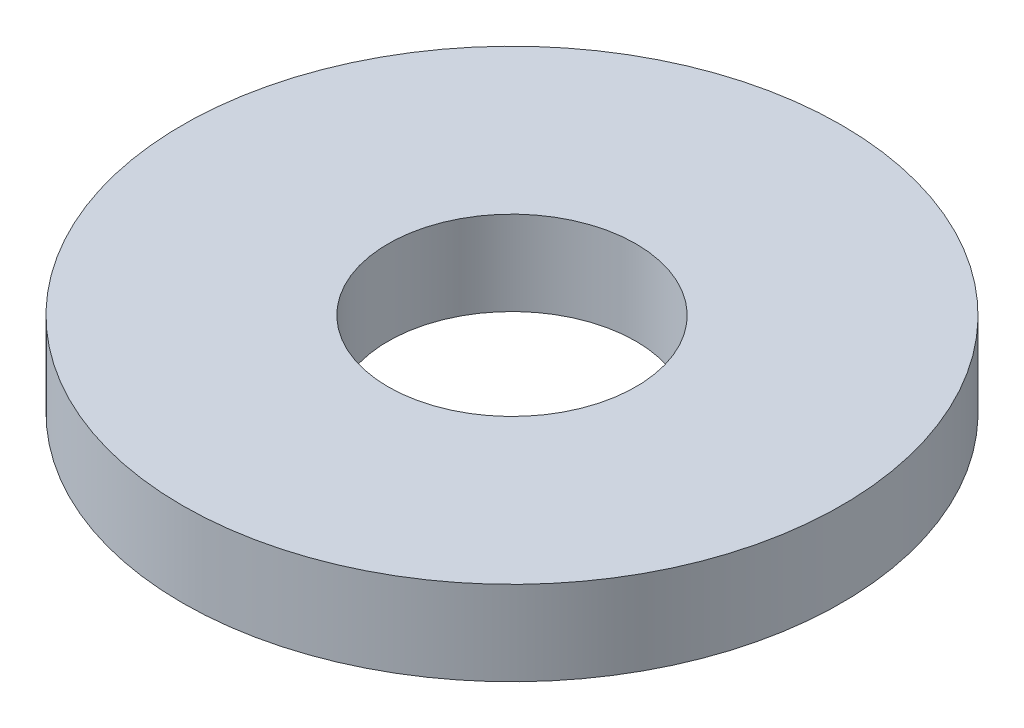
ISO-10303-21;
HEADER;
FILE_DESCRIPTION(('STEP AP214'),'2;1');
FILE_NAME('part.step','',(''),(''),'','','');
FILE_SCHEMA(('AUTOMOTIVE_DESIGN { 1 0 10303 214 1 1 1 1 }'));
ENDSEC;
DATA;
#1=APPLICATION_CONTEXT('core data for automotive mechanical design processes');
#2=APPLICATION_PROTOCOL_DEFINITION('international standard','automotive_design',2000,#1);
#3=PRODUCT_CONTEXT('',#1,'mechanical');
#4=PRODUCT('Part','Part','',(#3));
#5=PRODUCT_RELATED_PRODUCT_CATEGORY('part','',(#4));
#6=PRODUCT_DEFINITION_FORMATION('','',#4);
#7=PRODUCT_DEFINITION_CONTEXT('part definition',#1,'design');
#8=PRODUCT_DEFINITION('design','',#6,#7);
#9=PRODUCT_DEFINITION_SHAPE('','',#8);
#10=(LENGTH_UNIT() NAMED_UNIT(*) SI_UNIT(.MILLI.,.METRE.));
#11=(NAMED_UNIT(*) PLANE_ANGLE_UNIT() SI_UNIT($,.RADIAN.));
#12=(NAMED_UNIT(*) SI_UNIT($,.STERADIAN.) SOLID_ANGLE_UNIT());
#13=UNCERTAINTY_MEASURE_WITH_UNIT(LENGTH_MEASURE(1.E-05),#10,'distance_accuracy_value','');
#14=(GEOMETRIC_REPRESENTATION_CONTEXT(3) GLOBAL_UNCERTAINTY_ASSIGNED_CONTEXT((#13)) GLOBAL_UNIT_ASSIGNED_CONTEXT((#10,
#11,#12)) REPRESENTATION_CONTEXT('',''));
#15=CARTESIAN_POINT('',(0.,0.,0.));
#16=DIRECTION('',(0.,0.,1.));
#17=DIRECTION('',(1.,0.,0.));
#18=AXIS2_PLACEMENT_3D('',#15,#16,#17);
#19=CARTESIAN_POINT('',(3.5527136788005E-12,0.812799999993397,9.76996261670138E-12));
#20=DIRECTION('',(0.,-1.00000000000003,0.));
#21=DIRECTION('',(0.,0.,-1.00000000000019));
#22=AXIS2_PLACEMENT_3D('',#19,#20,#21);
#23=CYLINDRICAL_SURFACE('',#22,3.175);
#24=CARTESIAN_POINT('',(3.5527136788005E-12,0.812799999993397,9.76996261670138E-12));
#25=DIRECTION('',(0.,1.00000000000003,0.));
#26=DIRECTION('',(0.,0.,1.00000000000019));
#27=AXIS2_PLACEMENT_3D('',#24,#25,#26);
#28=CIRCLE('',#27,3.175);
#29=CARTESIAN_POINT('',(3.53041831879786E-12,0.812799999993504,3.17500000001038));
#30=VERTEX_POINT('',#29);
#31=EDGE_CURVE('E10',#30,#30,#28,.T.);
#32=ORIENTED_EDGE('',*,*,#31,.F.);
#33=EDGE_LOOP('',(#32));
#34=FACE_BOUND('',#33,.T.);
#35=CARTESIAN_POINT('',(0.,0.,0.));
#36=DIRECTION('',(0.,1.00000000000003,0.));
#37=DIRECTION('',(0.,0.,1.00000000000019));
#38=AXIS2_PLACEMENT_3D('',#35,#36,#37);
#39=CIRCLE('',#38,3.175);
#40=CARTESIAN_POINT('',(0.,1.07070602384241E-13,3.17500000000061));
#41=VERTEX_POINT('',#40);
#42=EDGE_CURVE('E37',#41,#41,#39,.T.);
#43=ORIENTED_EDGE('',*,*,#42,.T.);
#44=EDGE_LOOP('',(#43));
#45=FACE_BOUND('',#44,.T.);
#46=ADVANCED_FACE('F34',(#34,#45),#23,.T.);
#47=CARTESIAN_POINT('',(3.5527136788005E-12,0.812799999993397,9.76996261670138E-12));
#48=DIRECTION('',(0.,1.00000000000003,0.));
#49=DIRECTION('',(0.,0.,1.00000000000019));
#50=AXIS2_PLACEMENT_3D('',#47,#48,#49);
#51=PLANE('',#50);
#52=CARTESIAN_POINT('',(3.5527136788005E-12,0.812799999993397,9.76996261670138E-12));
#53=DIRECTION('',(0.,1.00000000000003,0.));
#54=DIRECTION('',(0.,0.,1.00000000000019));
#55=AXIS2_PLACEMENT_3D('',#52,#53,#54);
#56=CIRCLE('',#55,1.1938);
#57=CARTESIAN_POINT('',(3.54433062343951E-12,0.812799999993437,1.19380000001));
#58=VERTEX_POINT('',#57);
#59=EDGE_CURVE('E46',#58,#58,#56,.T.);
#60=ORIENTED_EDGE('',*,*,#59,.F.);
#61=EDGE_LOOP('',(#60));
#62=FACE_BOUND('',#61,.T.);
#63=ORIENTED_EDGE('',*,*,#31,.T.);
#64=EDGE_LOOP('',(#63));
#65=FACE_BOUND('',#64,.T.);
#66=ADVANCED_FACE('F61',(#62,#65),#51,.T.);
#67=CARTESIAN_POINT('',(0.,0.,0.));
#68=DIRECTION('',(0.,1.00000000000003,0.));
#69=DIRECTION('',(0.,0.,1.00000000000019));
#70=AXIS2_PLACEMENT_3D('',#67,#68,#69);
#71=PLANE('',#70);
#72=CARTESIAN_POINT('',(0.,0.,0.));
#73=DIRECTION('',(0.,1.00000000000003,0.));
#74=DIRECTION('',(0.,0.,1.00000000000019));
#75=AXIS2_PLACEMENT_3D('',#72,#73,#74);
#76=CIRCLE('',#75,1.1938);
#77=CARTESIAN_POINT('',(0.,0.,1.19380000000023));
#78=VERTEX_POINT('',#77);
#79=EDGE_CURVE('E44',#78,#78,#76,.T.);
#80=ORIENTED_EDGE('',*,*,#79,.T.);
#81=EDGE_LOOP('',(#80));
#82=FACE_BOUND('',#81,.T.);
#83=ORIENTED_EDGE('',*,*,#42,.F.);
#84=EDGE_LOOP('',(#83));
#85=FACE_BOUND('',#84,.T.);
#86=ADVANCED_FACE('F52',(#82,#85),#71,.F.);
#87=CARTESIAN_POINT('',(0.,0.,0.));
#88=DIRECTION('',(0.,1.00000000000003,0.));
#89=DIRECTION('',(0.,0.,1.00000000000019));
#90=AXIS2_PLACEMENT_3D('',#87,#88,#89);
#91=CYLINDRICAL_SURFACE('',#90,1.1938);
#92=ORIENTED_EDGE('',*,*,#79,.F.);
#93=EDGE_LOOP('',(#92));
#94=FACE_BOUND('',#93,.T.);
#95=ORIENTED_EDGE('',*,*,#59,.T.);
#96=EDGE_LOOP('',(#95));
#97=FACE_BOUND('',#96,.T.);
#98=ADVANCED_FACE('F55',(#94,#97),#91,.F.);
#99=CLOSED_SHELL('',(#46,#66,#86,#98));
#100=MANIFOLD_SOLID_BREP('B2',#99);
#101=ADVANCED_BREP_SHAPE_REPRESENTATION('',(#18,#100),#14);
#102=SHAPE_DEFINITION_REPRESENTATION(#9,#101);
ENDSEC;
END-ISO-10303-21;
